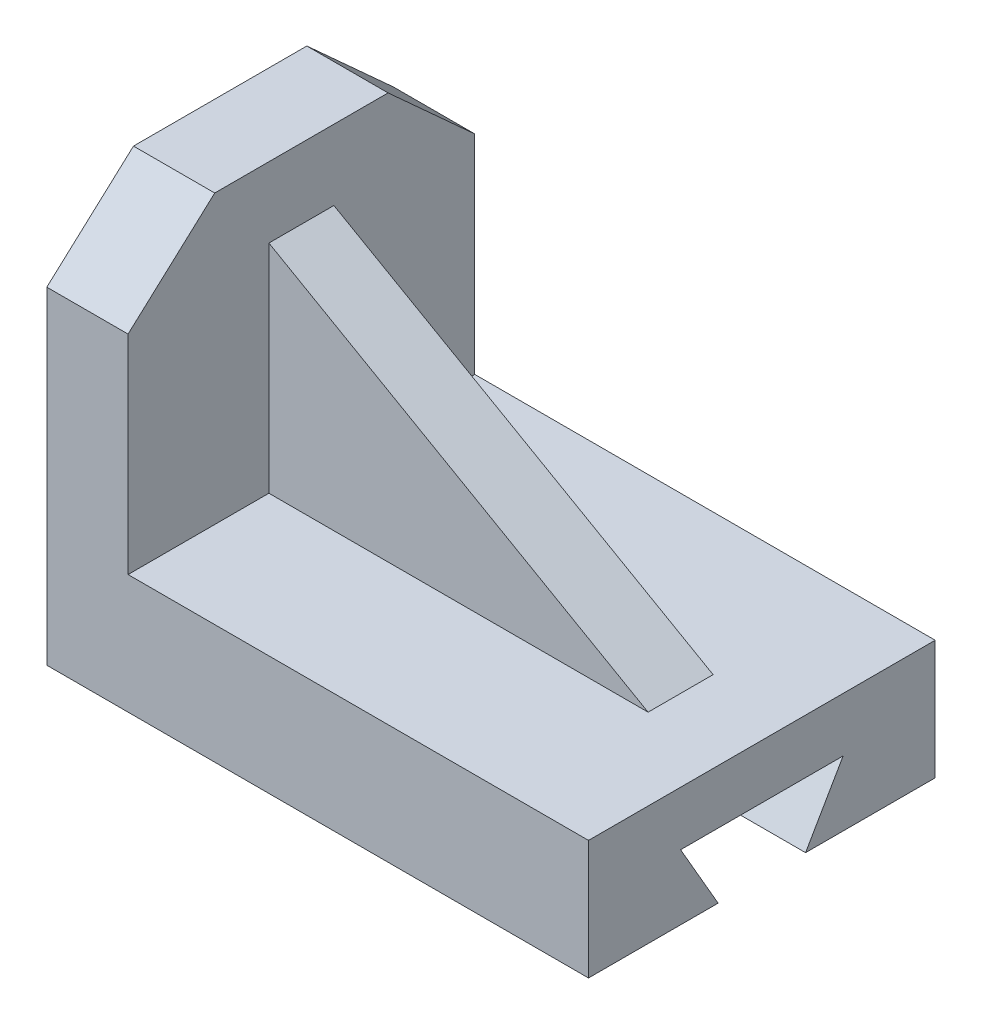
ISO-10303-21;
HEADER;
FILE_DESCRIPTION(('STEP AP214'),'2;1');
FILE_NAME('part.step','',(''),(''),'','','');
FILE_SCHEMA(('AUTOMOTIVE_DESIGN { 1 0 10303 214 1 1 1 1 }'));
ENDSEC;
DATA;
#1=APPLICATION_CONTEXT('core data for automotive mechanical design processes');
#2=APPLICATION_PROTOCOL_DEFINITION('international standard','automotive_design',2000,#1);
#3=PRODUCT_CONTEXT('',#1,'mechanical');
#4=PRODUCT('Part','Part','',(#3));
#5=PRODUCT_RELATED_PRODUCT_CATEGORY('part','',(#4));
#6=PRODUCT_DEFINITION_FORMATION('','',#4);
#7=PRODUCT_DEFINITION_CONTEXT('part definition',#1,'design');
#8=PRODUCT_DEFINITION('design','',#6,#7);
#9=PRODUCT_DEFINITION_SHAPE('','',#8);
#10=(LENGTH_UNIT() NAMED_UNIT(*) SI_UNIT(.MILLI.,.METRE.));
#11=(NAMED_UNIT(*) PLANE_ANGLE_UNIT() SI_UNIT($,.RADIAN.));
#12=(NAMED_UNIT(*) SI_UNIT($,.STERADIAN.) SOLID_ANGLE_UNIT());
#13=UNCERTAINTY_MEASURE_WITH_UNIT(LENGTH_MEASURE(1.E-05),#10,'distance_accuracy_value','');
#14=(GEOMETRIC_REPRESENTATION_CONTEXT(3) GLOBAL_UNCERTAINTY_ASSIGNED_CONTEXT((#13)) GLOBAL_UNIT_ASSIGNED_CONTEXT((#10,
#11,#12)) REPRESENTATION_CONTEXT('',''));
#15=CARTESIAN_POINT('',(0.,0.,0.));
#16=DIRECTION('',(0.,0.,1.));
#17=DIRECTION('',(1.,0.,0.));
#18=AXIS2_PLACEMENT_3D('',#15,#16,#17);
#19=CARTESIAN_POINT('',(0.,-35.5013262599469,32.));
#20=DIRECTION('',(0.,1.,0.));
#21=DIRECTION('',(0.,0.,1.));
#22=AXIS2_PLACEMENT_3D('',#19,#20,#21);
#23=PLANE('',#22);
#24=DIRECTION('',(0.,0.,-1.));
#25=VECTOR('',#24,1.);
#26=CARTESIAN_POINT('',(71.853066107563,-35.5013262599469,32.));
#27=LINE('',#26,#25);
#28=CARTESIAN_POINT('',(71.853066107563,-35.5013262599469,-8.07179676972442));
#29=VERTEX_POINT('',#28);
#30=CARTESIAN_POINT('',(71.853066107563,-35.5013262599469,-32.));
#31=VERTEX_POINT('',#30);
#32=EDGE_CURVE('E252',#29,#31,#27,.T.);
#33=ORIENTED_EDGE('',*,*,#32,.F.);
#34=DIRECTION('',(1.,0.,0.));
#35=VECTOR('',#34,1.);
#36=CARTESIAN_POINT('',(-28.147933892437,-35.5013262599469,-8.07179676972442));
#37=LINE('',#36,#35);
#38=CARTESIAN_POINT('',(-28.146933892437,-35.5013262599469,-8.07179676972442));
#39=VERTEX_POINT('',#38);
#40=EDGE_CURVE('E166',#39,#29,#37,.T.);
#41=ORIENTED_EDGE('',*,*,#40,.F.);
#42=DIRECTION('',(0.,0.,-1.));
#43=VECTOR('',#42,1.);
#44=CARTESIAN_POINT('',(-28.146933892437,-35.5013262599469,32.));
#45=LINE('',#44,#43);
#46=CARTESIAN_POINT('',(-28.146933892437,-35.5013262599469,-32.));
#47=VERTEX_POINT('',#46);
#48=EDGE_CURVE('E171',#39,#47,#45,.T.);
#49=ORIENTED_EDGE('',*,*,#48,.T.);
#50=DIRECTION('',(1.,0.,0.));
#51=VECTOR('',#50,1.);
#52=CARTESIAN_POINT('',(0.,-35.5013262599469,-32.));
#53=LINE('',#52,#51);
#54=EDGE_CURVE('E240',#47,#31,#53,.T.);
#55=ORIENTED_EDGE('',*,*,#54,.T.);
#56=EDGE_LOOP('',(#33,#41,#49,#55));
#57=FACE_BOUND('',#56,.T.);
#58=ADVANCED_FACE('F43',(#57),#23,.F.);
#59=CARTESIAN_POINT('',(-13.146933892437,0.,32.));
#60=DIRECTION('',(1.,0.,0.));
#61=DIRECTION('',(0.,1.,0.));
#62=AXIS2_PLACEMENT_3D('',#59,#60,#61);
#63=PLANE('',#62);
#64=DIRECTION('',(0.,0.,-1.));
#65=VECTOR('',#64,1.);
#66=CARTESIAN_POINT('',(-13.146933892437,39.4986737400531,32.));
#67=LINE('',#66,#65);
#68=CARTESIAN_POINT('',(-13.146933892437,39.4986737400531,16.));
#69=VERTEX_POINT('',#68);
#70=CARTESIAN_POINT('',(-13.146933892437,39.4986737400531,-16.));
#71=VERTEX_POINT('',#70);
#72=EDGE_CURVE('E51',#69,#71,#67,.T.);
#73=ORIENTED_EDGE('',*,*,#72,.F.);
#74=DIRECTION('',(0.,-0.672842851200014,0.739785440238612));
#75=VECTOR('',#74,1.);
#76=CARTESIAN_POINT('',(-13.146933892437,29.5810823340932,26.9043140033061));
#77=LINE('',#76,#75);
#78=CARTESIAN_POINT('',(-13.146933892437,24.9465008617549,32.));
#79=VERTEX_POINT('',#78);
#80=EDGE_CURVE('E186',#69,#79,#77,.T.);
#81=ORIENTED_EDGE('',*,*,#80,.T.);
#82=DIRECTION('',(0.,-1.,0.));
#83=VECTOR('',#82,1.);
#84=CARTESIAN_POINT('',(-13.146933892437,0.,32.));
#85=LINE('',#84,#83);
#86=CARTESIAN_POINT('',(-13.146933892437,-13.5013262599469,32.));
#87=VERTEX_POINT('',#86);
#88=EDGE_CURVE('E224',#79,#87,#85,.T.);
#89=ORIENTED_EDGE('',*,*,#88,.T.);
#90=DIRECTION('',(0.,0.,1.));
#91=VECTOR('',#90,1.);
#92=CARTESIAN_POINT('',(-13.146933892437,-13.5013262599469,11.));
#93=LINE('',#92,#91);
#94=CARTESIAN_POINT('',(-13.146933892437,-13.5013262599469,6.));
#95=VERTEX_POINT('',#94);
#96=EDGE_CURVE('E220',#95,#87,#93,.T.);
#97=ORIENTED_EDGE('',*,*,#96,.F.);
#98=DIRECTION('',(0.,-1.,0.));
#99=VECTOR('',#98,1.);
#100=CARTESIAN_POINT('',(-13.146933892437,-13.5013262599469,6.));
#101=LINE('',#100,#99);
#102=CARTESIAN_POINT('',(-13.146933892437,26.498673740053,6.));
#103=VERTEX_POINT('',#102);
#104=EDGE_CURVE('E209',#103,#95,#101,.T.);
#105=ORIENTED_EDGE('',*,*,#104,.F.);
#106=DIRECTION('',(0.,0.,-1.));
#107=VECTOR('',#106,1.);
#108=CARTESIAN_POINT('',(-13.146933892437,26.498673740053,32.));
#109=LINE('',#108,#107);
#110=CARTESIAN_POINT('',(-13.146933892437,26.498673740053,-6.));
#111=VERTEX_POINT('',#110);
#112=EDGE_CURVE('E12',#103,#111,#109,.T.);
#113=ORIENTED_EDGE('',*,*,#112,.T.);
#114=DIRECTION('',(0.,1.,0.));
#115=VECTOR('',#114,1.);
#116=CARTESIAN_POINT('',(-13.146933892437,-13.5013262599469,-6.));
#117=LINE('',#116,#115);
#118=CARTESIAN_POINT('',(-13.146933892437,-13.5013262599469,-6.));
#119=VERTEX_POINT('',#118);
#120=EDGE_CURVE('E193',#119,#111,#117,.T.);
#121=ORIENTED_EDGE('',*,*,#120,.F.);
#122=DIRECTION('',(0.,0.,-1.));
#123=VECTOR('',#122,1.);
#124=CARTESIAN_POINT('',(-13.146933892437,-13.5013262599469,-11.));
#125=LINE('',#124,#123);
#126=CARTESIAN_POINT('',(-13.146933892437,-13.5013262599469,-32.));
#127=VERTEX_POINT('',#126);
#128=EDGE_CURVE('E217',#119,#127,#125,.T.);
#129=ORIENTED_EDGE('',*,*,#128,.T.);
#130=DIRECTION('',(0.,-1.,0.));
#131=VECTOR('',#130,1.);
#132=CARTESIAN_POINT('',(-13.146933892437,0.,-32.));
#133=LINE('',#132,#131);
#134=CARTESIAN_POINT('',(-13.146933892437,24.9465008617549,-32.));
#135=VERTEX_POINT('',#134);
#136=EDGE_CURVE('E223',#135,#127,#133,.T.);
#137=ORIENTED_EDGE('',*,*,#136,.F.);
#138=DIRECTION('',(0.,-0.672842851200014,-0.739785440238612));
#139=VECTOR('',#138,1.);
#140=CARTESIAN_POINT('',(-13.146933892437,29.5810823340932,-26.9043140033061));
#141=LINE('',#140,#139);
#142=EDGE_CURVE('E165',#71,#135,#141,.T.);
#143=ORIENTED_EDGE('',*,*,#142,.F.);
#144=EDGE_LOOP('',(#73,#81,#89,#97,#105,#113,#121,#129,#137,#143));
#145=FACE_BOUND('',#144,.T.);
#146=ADVANCED_FACE('F269',(#145),#63,.T.);
#147=CARTESIAN_POINT('',(0.,39.4986737400531,32.));
#148=DIRECTION('',(0.,-1.,0.));
#149=DIRECTION('',(1.,0.,0.));
#150=AXIS2_PLACEMENT_3D('',#147,#148,#149);
#151=PLANE('',#150);
#152=DIRECTION('',(1.,0.,0.));
#153=VECTOR('',#152,1.);
#154=CARTESIAN_POINT('',(-28.147933892437,39.4986737400531,16.));
#155=LINE('',#154,#153);
#156=CARTESIAN_POINT('',(-28.146933892437,39.4986737400531,16.));
#157=VERTEX_POINT('',#156);
#158=EDGE_CURVE('E190',#157,#69,#155,.T.);
#159=ORIENTED_EDGE('',*,*,#158,.T.);
#160=ORIENTED_EDGE('',*,*,#72,.T.);
#161=DIRECTION('',(1.,0.,0.));
#162=VECTOR('',#161,1.);
#163=CARTESIAN_POINT('',(-28.147933892437,39.4986737400531,-16.));
#164=LINE('',#163,#162);
#165=CARTESIAN_POINT('',(-28.146933892437,39.4986737400531,-16.));
#166=VERTEX_POINT('',#165);
#167=EDGE_CURVE('E197',#166,#71,#164,.T.);
#168=ORIENTED_EDGE('',*,*,#167,.F.);
#169=DIRECTION('',(0.,0.,-1.));
#170=VECTOR('',#169,1.);
#171=CARTESIAN_POINT('',(-28.146933892437,39.4986737400531,32.));
#172=LINE('',#171,#170);
#173=EDGE_CURVE('E259',#157,#166,#172,.T.);
#174=ORIENTED_EDGE('',*,*,#173,.F.);
#175=EDGE_LOOP('',(#159,#160,#168,#174));
#176=FACE_BOUND('',#175,.T.);
#177=ADVANCED_FACE('F265',(#176),#151,.F.);
#178=CARTESIAN_POINT('',(-28.146933892437,0.,32.));
#179=DIRECTION('',(1.,0.,0.));
#180=DIRECTION('',(0.,1.,0.));
#181=AXIS2_PLACEMENT_3D('',#178,#179,#180);
#182=PLANE('',#181);
#183=ORIENTED_EDGE('',*,*,#48,.F.);
#184=DIRECTION('',(0.,-0.866025403784436,0.500000000000004));
#185=VECTOR('',#184,1.);
#186=CARTESIAN_POINT('',(-28.146933892437,-35.5013262599469,-8.07179676972442));
#187=LINE('',#186,#185);
#188=CARTESIAN_POINT('',(-28.146933892437,-23.5013262599469,-15.));
#189=VERTEX_POINT('',#188);
#190=EDGE_CURVE('E151',#189,#39,#187,.T.);
#191=ORIENTED_EDGE('',*,*,#190,.F.);
#192=DIRECTION('',(0.,0.,-1.));
#193=VECTOR('',#192,1.);
#194=CARTESIAN_POINT('',(-28.146933892437,-23.5013262599469,-15.));
#195=LINE('',#194,#193);
#196=CARTESIAN_POINT('',(-28.146933892437,-23.5013262599469,15.));
#197=VERTEX_POINT('',#196);
#198=EDGE_CURVE('E160',#197,#189,#195,.T.);
#199=ORIENTED_EDGE('',*,*,#198,.F.);
#200=DIRECTION('',(0.,0.866025403784437,0.500000000000004));
#201=VECTOR('',#200,1.);
#202=CARTESIAN_POINT('',(-28.146933892437,-35.5013262599469,8.07179676972442));
#203=LINE('',#202,#201);
#204=CARTESIAN_POINT('',(-28.146933892437,-35.5013262599469,8.07179676972442));
#205=VERTEX_POINT('',#204);
#206=EDGE_CURVE('E172',#205,#197,#203,.T.);
#207=ORIENTED_EDGE('',*,*,#206,.F.);
#208=CARTESIAN_POINT('',(-28.146933892437,-35.5013262599469,32.));
#209=VERTEX_POINT('',#208);
#210=EDGE_CURVE('E256',#209,#205,#45,.T.);
#211=ORIENTED_EDGE('',*,*,#210,.F.);
#212=DIRECTION('',(0.,-1.,0.));
#213=VECTOR('',#212,1.);
#214=CARTESIAN_POINT('',(-28.146933892437,0.,32.));
#215=LINE('',#214,#213);
#216=CARTESIAN_POINT('',(-28.146933892437,24.9465008617549,32.));
#217=VERTEX_POINT('',#216);
#218=EDGE_CURVE('E226',#217,#209,#215,.T.);
#219=ORIENTED_EDGE('',*,*,#218,.F.);
#220=DIRECTION('',(0.,0.672842851200014,-0.739785440238612));
#221=VECTOR('',#220,1.);
#222=CARTESIAN_POINT('',(-28.146933892437,29.5810823340932,26.9043140033061));
#223=LINE('',#222,#221);
#224=EDGE_CURVE('E66',#217,#157,#223,.T.);
#225=ORIENTED_EDGE('',*,*,#224,.T.);
#226=ORIENTED_EDGE('',*,*,#173,.T.);
#227=DIRECTION('',(0.,0.672842851200014,0.739785440238612));
#228=VECTOR('',#227,1.);
#229=CARTESIAN_POINT('',(-28.146933892437,29.5810823340932,-26.9043140033061));
#230=LINE('',#229,#228);
#231=CARTESIAN_POINT('',(-28.146933892437,24.9465008617549,-32.));
#232=VERTEX_POINT('',#231);
#233=EDGE_CURVE('E187',#232,#166,#230,.T.);
#234=ORIENTED_EDGE('',*,*,#233,.F.);
#235=DIRECTION('',(0.,-1.,0.));
#236=VECTOR('',#235,1.);
#237=CARTESIAN_POINT('',(-28.146933892437,0.,-32.));
#238=LINE('',#237,#236);
#239=EDGE_CURVE('E238',#232,#47,#238,.T.);
#240=ORIENTED_EDGE('',*,*,#239,.T.);
#241=EDGE_LOOP('',(#183,#191,#199,#207,#211,#219,#225,#226,#234,#240));
#242=FACE_BOUND('',#241,.T.);
#243=ADVANCED_FACE('F169',(#242),#182,.F.);
#244=CARTESIAN_POINT('',(0.,0.,32.));
#245=DIRECTION('',(0.,0.,1.));
#246=DIRECTION('',(1.,0.,0.));
#247=AXIS2_PLACEMENT_3D('',#244,#245,#246);
#248=PLANE('',#247);
#249=ORIENTED_EDGE('',*,*,#88,.F.);
#250=DIRECTION('',(1.,0.,0.));
#251=VECTOR('',#250,1.);
#252=CARTESIAN_POINT('',(-28.147933892437,24.9465008617549,32.));
#253=LINE('',#252,#251);
#254=EDGE_CURVE('E191',#217,#79,#253,.T.);
#255=ORIENTED_EDGE('',*,*,#254,.F.);
#256=ORIENTED_EDGE('',*,*,#218,.T.);
#257=DIRECTION('',(1.,0.,0.));
#258=VECTOR('',#257,1.);
#259=CARTESIAN_POINT('',(0.,-35.5013262599469,32.));
#260=LINE('',#259,#258);
#261=CARTESIAN_POINT('',(71.853066107563,-35.5013262599469,32.));
#262=VERTEX_POINT('',#261);
#263=EDGE_CURVE('E229',#209,#262,#260,.T.);
#264=ORIENTED_EDGE('',*,*,#263,.T.);
#265=DIRECTION('',(0.,1.,0.));
#266=VECTOR('',#265,1.);
#267=CARTESIAN_POINT('',(71.853066107563,0.,32.));
#268=LINE('',#267,#266);
#269=CARTESIAN_POINT('',(71.853066107563,-13.5013262599469,32.));
#270=VERTEX_POINT('',#269);
#271=EDGE_CURVE('E231',#262,#270,#268,.T.);
#272=ORIENTED_EDGE('',*,*,#271,.T.);
#273=DIRECTION('',(-1.,0.,0.));
#274=VECTOR('',#273,1.);
#275=CARTESIAN_POINT('',(0.,-13.5013262599469,32.));
#276=LINE('',#275,#274);
#277=EDGE_CURVE('E233',#270,#87,#276,.T.);
#278=ORIENTED_EDGE('',*,*,#277,.T.);
#279=EDGE_LOOP('',(#249,#255,#256,#264,#272,#278));
#280=FACE_BOUND('',#279,.T.);
#281=ADVANCED_FACE('F285',(#280),#248,.T.);
#282=CARTESIAN_POINT('',(8.17864496065374,14.3126286811441,32.));
#283=DIRECTION('',(0.496138938356834,0.868243142124459,0.));
#284=DIRECTION('',(-0.868243142124459,0.496138938356834,0.));
#285=AXIS2_PLACEMENT_3D('',#282,#283,#284);
#286=PLANE('',#285);
#287=DIRECTION('',(0.868243142124459,-0.496138938356834,0.));
#288=VECTOR('',#287,1.);
#289=CARTESIAN_POINT('',(-13.146933892437,26.498673740053,-6.));
#290=LINE('',#289,#288);
#291=CARTESIAN_POINT('',(56.853066107563,-13.5013262599469,-6.));
#292=VERTEX_POINT('',#291);
#293=EDGE_CURVE('E204',#111,#292,#290,.T.);
#294=ORIENTED_EDGE('',*,*,#293,.F.);
#295=ORIENTED_EDGE('',*,*,#112,.F.);
#296=DIRECTION('',(-0.868243142124459,0.496138938356834,0.));
#297=VECTOR('',#296,1.);
#298=CARTESIAN_POINT('',(-13.146933892437,26.498673740053,6.));
#299=LINE('',#298,#297);
#300=CARTESIAN_POINT('',(56.853066107563,-13.5013262599469,6.));
#301=VERTEX_POINT('',#300);
#302=EDGE_CURVE('E214',#301,#103,#299,.T.);
#303=ORIENTED_EDGE('',*,*,#302,.F.);
#304=DIRECTION('',(0.,0.,-1.));
#305=VECTOR('',#304,1.);
#306=CARTESIAN_POINT('',(56.853066107563,-13.5013262599469,32.));
#307=LINE('',#306,#305);
#308=EDGE_CURVE('E236',#301,#292,#307,.T.);
#309=ORIENTED_EDGE('',*,*,#308,.T.);
#310=EDGE_LOOP('',(#294,#295,#303,#309));
#311=FACE_BOUND('',#310,.T.);
#312=ADVANCED_FACE('F45',(#311),#286,.T.);
#313=ORIENTED_EDGE('',*,*,#210,.T.);
#314=DIRECTION('',(1.,0.,0.));
#315=VECTOR('',#314,1.);
#316=CARTESIAN_POINT('',(-28.147933892437,-35.5013262599469,8.07179676972442));
#317=LINE('',#316,#315);
#318=CARTESIAN_POINT('',(71.853066107563,-35.5013262599469,8.07179676972442));
#319=VERTEX_POINT('',#318);
#320=EDGE_CURVE('E181',#205,#319,#317,.T.);
#321=ORIENTED_EDGE('',*,*,#320,.T.);
#322=EDGE_CURVE('E253',#262,#319,#27,.T.);
#323=ORIENTED_EDGE('',*,*,#322,.F.);
#324=ORIENTED_EDGE('',*,*,#263,.F.);
#325=EDGE_LOOP('',(#313,#321,#323,#324));
#326=FACE_BOUND('',#325,.T.);
#327=ADVANCED_FACE('F301',(#326),#23,.F.);
#328=CARTESIAN_POINT('',(71.853066107563,0.,32.));
#329=DIRECTION('',(-1.,0.,0.));
#330=DIRECTION('',(0.,0.,1.));
#331=AXIS2_PLACEMENT_3D('',#328,#329,#330);
#332=PLANE('',#331);
#333=DIRECTION('',(0.,0.,1.));
#334=VECTOR('',#333,1.);
#335=CARTESIAN_POINT('',(71.853066107563,-23.5013262599469,-15.));
#336=LINE('',#335,#334);
#337=CARTESIAN_POINT('',(71.853066107563,-23.5013262599469,-15.));
#338=VERTEX_POINT('',#337);
#339=CARTESIAN_POINT('',(71.853066107563,-23.5013262599469,15.));
#340=VERTEX_POINT('',#339);
#341=EDGE_CURVE('E174',#338,#340,#336,.T.);
#342=ORIENTED_EDGE('',*,*,#341,.F.);
#343=DIRECTION('',(0.,0.866025403784436,-0.500000000000004));
#344=VECTOR('',#343,1.);
#345=CARTESIAN_POINT('',(71.853066107563,-35.5013262599469,-8.07179676972442));
#346=LINE('',#345,#344);
#347=EDGE_CURVE('E58',#29,#338,#346,.T.);
#348=ORIENTED_EDGE('',*,*,#347,.F.);
#349=ORIENTED_EDGE('',*,*,#32,.T.);
#350=DIRECTION('',(0.,1.,0.));
#351=VECTOR('',#350,1.);
#352=CARTESIAN_POINT('',(71.853066107563,0.,-32.));
#353=LINE('',#352,#351);
#354=CARTESIAN_POINT('',(71.853066107563,-13.5013262599469,-32.));
#355=VERTEX_POINT('',#354);
#356=EDGE_CURVE('E243',#31,#355,#353,.T.);
#357=ORIENTED_EDGE('',*,*,#356,.T.);
#358=DIRECTION('',(0.,0.,-1.));
#359=VECTOR('',#358,1.);
#360=CARTESIAN_POINT('',(71.853066107563,-13.5013262599469,32.));
#361=LINE('',#360,#359);
#362=EDGE_CURVE('E249',#270,#355,#361,.T.);
#363=ORIENTED_EDGE('',*,*,#362,.F.);
#364=ORIENTED_EDGE('',*,*,#271,.F.);
#365=ORIENTED_EDGE('',*,*,#322,.T.);
#366=DIRECTION('',(0.,-0.866025403784437,-0.500000000000003));
#367=VECTOR('',#366,1.);
#368=CARTESIAN_POINT('',(71.853066107563,-35.5013262599469,8.07179676972442));
#369=LINE('',#368,#367);
#370=EDGE_CURVE('E157',#340,#319,#369,.T.);
#371=ORIENTED_EDGE('',*,*,#370,.F.);
#372=EDGE_LOOP('',(#342,#348,#349,#357,#363,#364,#365,#371));
#373=FACE_BOUND('',#372,.T.);
#374=ADVANCED_FACE('F309',(#373),#332,.F.);
#375=CARTESIAN_POINT('',(0.,-13.5013262599469,32.));
#376=DIRECTION('',(0.,-1.,0.));
#377=DIRECTION('',(0.,0.,-1.));
#378=AXIS2_PLACEMENT_3D('',#375,#376,#377);
#379=PLANE('',#378);
#380=ORIENTED_EDGE('',*,*,#308,.F.);
#381=DIRECTION('',(1.,0.,0.));
#382=VECTOR('',#381,1.);
#383=CARTESIAN_POINT('',(56.853066107563,-13.5013262599469,6.));
#384=LINE('',#383,#382);
#385=EDGE_CURVE('E212',#95,#301,#384,.T.);
#386=ORIENTED_EDGE('',*,*,#385,.F.);
#387=ORIENTED_EDGE('',*,*,#96,.T.);
#388=ORIENTED_EDGE('',*,*,#277,.F.);
#389=ORIENTED_EDGE('',*,*,#362,.T.);
#390=DIRECTION('',(-1.,0.,0.));
#391=VECTOR('',#390,1.);
#392=CARTESIAN_POINT('',(0.,-13.5013262599469,-32.));
#393=LINE('',#392,#391);
#394=EDGE_CURVE('E227',#355,#127,#393,.T.);
#395=ORIENTED_EDGE('',*,*,#394,.T.);
#396=ORIENTED_EDGE('',*,*,#128,.F.);
#397=DIRECTION('',(-1.,0.,0.));
#398=VECTOR('',#397,1.);
#399=CARTESIAN_POINT('',(56.853066107563,-13.5013262599469,-6.));
#400=LINE('',#399,#398);
#401=EDGE_CURVE('E206',#292,#119,#400,.T.);
#402=ORIENTED_EDGE('',*,*,#401,.F.);
#403=EDGE_LOOP('',(#380,#386,#387,#388,#389,#395,#396,#402));
#404=FACE_BOUND('',#403,.T.);
#405=ADVANCED_FACE('F315',(#404),#379,.F.);
#406=CARTESIAN_POINT('',(0.,0.,-32.));
#407=DIRECTION('',(0.,0.,1.));
#408=DIRECTION('',(1.,0.,0.));
#409=AXIS2_PLACEMENT_3D('',#406,#407,#408);
#410=PLANE('',#409);
#411=ORIENTED_EDGE('',*,*,#239,.F.);
#412=DIRECTION('',(1.,0.,0.));
#413=VECTOR('',#412,1.);
#414=CARTESIAN_POINT('',(-28.147933892437,24.9465008617549,-32.));
#415=LINE('',#414,#413);
#416=EDGE_CURVE('E198',#232,#135,#415,.T.);
#417=ORIENTED_EDGE('',*,*,#416,.T.);
#418=ORIENTED_EDGE('',*,*,#136,.T.);
#419=ORIENTED_EDGE('',*,*,#394,.F.);
#420=ORIENTED_EDGE('',*,*,#356,.F.);
#421=ORIENTED_EDGE('',*,*,#54,.F.);
#422=EDGE_LOOP('',(#411,#417,#418,#419,#420,#421));
#423=FACE_BOUND('',#422,.T.);
#424=ADVANCED_FACE('F277',(#423),#410,.F.);
#425=CARTESIAN_POINT('',(0.,0.,6.));
#426=DIRECTION('',(0.,0.,1.));
#427=DIRECTION('',(1.,0.,0.));
#428=AXIS2_PLACEMENT_3D('',#425,#426,#427);
#429=PLANE('',#428);
#430=ORIENTED_EDGE('',*,*,#104,.T.);
#431=ORIENTED_EDGE('',*,*,#385,.T.);
#432=ORIENTED_EDGE('',*,*,#302,.T.);
#433=EDGE_LOOP('',(#430,#431,#432));
#434=FACE_BOUND('',#433,.T.);
#435=ADVANCED_FACE('F329',(#434),#429,.T.);
#436=CARTESIAN_POINT('',(0.,0.,-6.));
#437=DIRECTION('',(0.,0.,1.));
#438=DIRECTION('',(1.,0.,0.));
#439=AXIS2_PLACEMENT_3D('',#436,#437,#438);
#440=PLANE('',#439);
#441=ORIENTED_EDGE('',*,*,#120,.T.);
#442=ORIENTED_EDGE('',*,*,#293,.T.);
#443=ORIENTED_EDGE('',*,*,#401,.T.);
#444=EDGE_LOOP('',(#441,#442,#443));
#445=FACE_BOUND('',#444,.T.);
#446=ADVANCED_FACE('F296',(#445),#440,.F.);
#447=CARTESIAN_POINT('',(-28.147933892437,29.5810823340932,-26.9043140033061));
#448=DIRECTION('',(0.,-0.739785440238612,0.672842851200014));
#449=DIRECTION('',(0.,-0.672842851200014,-0.739785440238612));
#450=AXIS2_PLACEMENT_3D('',#447,#448,#449);
#451=PLANE('',#450);
#452=ORIENTED_EDGE('',*,*,#233,.T.);
#453=ORIENTED_EDGE('',*,*,#167,.T.);
#454=ORIENTED_EDGE('',*,*,#142,.T.);
#455=ORIENTED_EDGE('',*,*,#416,.F.);
#456=EDGE_LOOP('',(#452,#453,#454,#455));
#457=FACE_BOUND('',#456,.T.);
#458=ADVANCED_FACE('F273',(#457),#451,.F.);
#459=CARTESIAN_POINT('',(-28.147933892437,29.5810823340932,26.9043140033061));
#460=DIRECTION('',(0.,0.739785440238612,0.672842851200014));
#461=DIRECTION('',(0.,-0.672842851200014,0.739785440238612));
#462=AXIS2_PLACEMENT_3D('',#459,#460,#461);
#463=PLANE('',#462);
#464=ORIENTED_EDGE('',*,*,#254,.T.);
#465=ORIENTED_EDGE('',*,*,#80,.F.);
#466=ORIENTED_EDGE('',*,*,#158,.F.);
#467=ORIENTED_EDGE('',*,*,#224,.F.);
#468=EDGE_LOOP('',(#464,#465,#466,#467));
#469=FACE_BOUND('',#468,.T.);
#470=ADVANCED_FACE('F287',(#469),#463,.T.);
#471=CARTESIAN_POINT('',(-28.147933892437,-35.5013262599469,-8.07179676972442));
#472=DIRECTION('',(0.,-0.500000000000004,-0.866025403784436));
#473=DIRECTION('',(0.,0.866025403784436,-0.500000000000004));
#474=AXIS2_PLACEMENT_3D('',#471,#472,#473);
#475=PLANE('',#474);
#476=ORIENTED_EDGE('',*,*,#190,.T.);
#477=ORIENTED_EDGE('',*,*,#40,.T.);
#478=ORIENTED_EDGE('',*,*,#347,.T.);
#479=DIRECTION('',(1.,0.,0.));
#480=VECTOR('',#479,1.);
#481=CARTESIAN_POINT('',(-28.147933892437,-23.5013262599469,-15.));
#482=LINE('',#481,#480);
#483=EDGE_CURVE('E147',#189,#338,#482,.T.);
#484=ORIENTED_EDGE('',*,*,#483,.F.);
#485=EDGE_LOOP('',(#476,#477,#478,#484));
#486=FACE_BOUND('',#485,.T.);
#487=ADVANCED_FACE('F149',(#486),#475,.F.);
#488=CARTESIAN_POINT('',(-28.147933892437,-35.5013262599469,8.07179676972442));
#489=DIRECTION('',(0.,-0.500000000000003,0.866025403784437));
#490=DIRECTION('',(0.,-0.866025403784437,-0.500000000000004));
#491=AXIS2_PLACEMENT_3D('',#488,#489,#490);
#492=PLANE('',#491);
#493=ORIENTED_EDGE('',*,*,#206,.T.);
#494=DIRECTION('',(1.,0.,0.));
#495=VECTOR('',#494,1.);
#496=CARTESIAN_POINT('',(-28.147933892437,-23.5013262599469,15.));
#497=LINE('',#496,#495);
#498=EDGE_CURVE('E156',#197,#340,#497,.T.);
#499=ORIENTED_EDGE('',*,*,#498,.T.);
#500=ORIENTED_EDGE('',*,*,#370,.T.);
#501=ORIENTED_EDGE('',*,*,#320,.F.);
#502=EDGE_LOOP('',(#493,#499,#500,#501));
#503=FACE_BOUND('',#502,.T.);
#504=ADVANCED_FACE('F294',(#503),#492,.F.);
#505=CARTESIAN_POINT('',(-28.147933892437,-23.5013262599469,-15.));
#506=DIRECTION('',(0.,1.,0.));
#507=DIRECTION('',(0.,0.,1.));
#508=AXIS2_PLACEMENT_3D('',#505,#506,#507);
#509=PLANE('',#508);
#510=ORIENTED_EDGE('',*,*,#198,.T.);
#511=ORIENTED_EDGE('',*,*,#483,.T.);
#512=ORIENTED_EDGE('',*,*,#341,.T.);
#513=ORIENTED_EDGE('',*,*,#498,.F.);
#514=EDGE_LOOP('',(#510,#511,#512,#513));
#515=FACE_BOUND('',#514,.T.);
#516=ADVANCED_FACE('F161',(#515),#509,.F.);
#517=CLOSED_SHELL('',(#58,#146,#177,#243,#281,#312,#327,#374,#405,#424,#435,#446,#458,#470,#487,
#504,#516));
#518=MANIFOLD_SOLID_BREP('B2',#517);
#519=ADVANCED_BREP_SHAPE_REPRESENTATION('',(#18,#518),#14);
#520=SHAPE_DEFINITION_REPRESENTATION(#9,#519);
ENDSEC;
END-ISO-10303-21;
